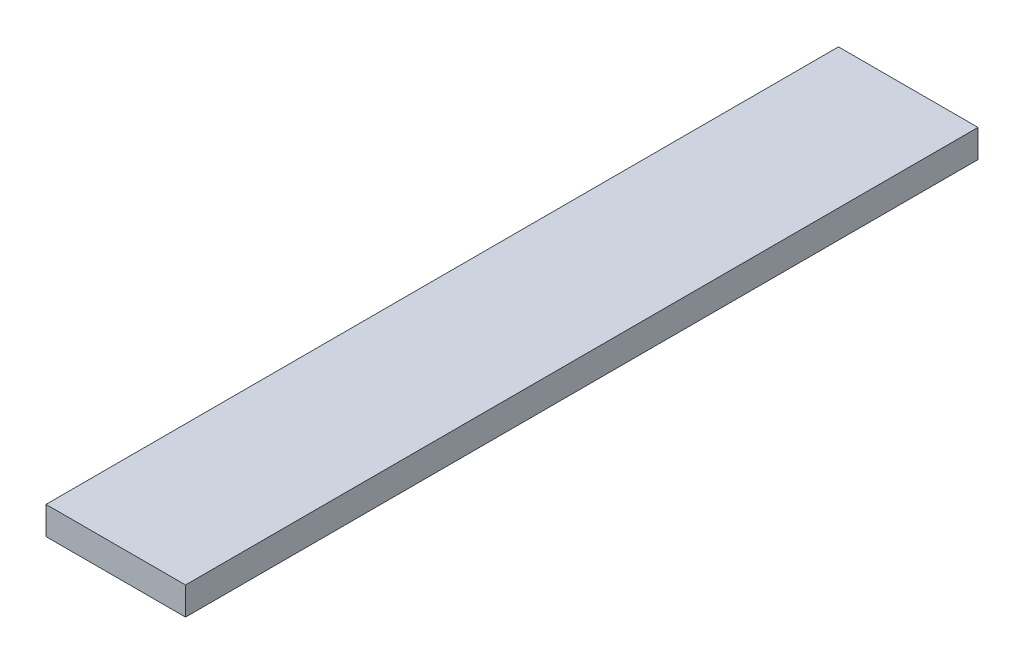
ISO-10303-21;
HEADER;
FILE_DESCRIPTION(('STEP AP214'),'2;1');
FILE_NAME('part.step','',(''),(''),'','','');
FILE_SCHEMA(('AUTOMOTIVE_DESIGN { 1 0 10303 214 1 1 1 1 }'));
ENDSEC;
DATA;
#1=APPLICATION_CONTEXT('core data for automotive mechanical design processes');
#2=APPLICATION_PROTOCOL_DEFINITION('international standard','automotive_design',2000,#1);
#3=PRODUCT_CONTEXT('',#1,'mechanical');
#4=PRODUCT('Part','Part','',(#3));
#5=PRODUCT_RELATED_PRODUCT_CATEGORY('part','',(#4));
#6=PRODUCT_DEFINITION_FORMATION('','',#4);
#7=PRODUCT_DEFINITION_CONTEXT('part definition',#1,'design');
#8=PRODUCT_DEFINITION('design','',#6,#7);
#9=PRODUCT_DEFINITION_SHAPE('','',#8);
#10=(LENGTH_UNIT() NAMED_UNIT(*) SI_UNIT(.MILLI.,.METRE.));
#11=(NAMED_UNIT(*) PLANE_ANGLE_UNIT() SI_UNIT($,.RADIAN.));
#12=(NAMED_UNIT(*) SI_UNIT($,.STERADIAN.) SOLID_ANGLE_UNIT());
#13=UNCERTAINTY_MEASURE_WITH_UNIT(LENGTH_MEASURE(1.E-05),#10,'distance_accuracy_value','');
#14=(GEOMETRIC_REPRESENTATION_CONTEXT(3) GLOBAL_UNCERTAINTY_ASSIGNED_CONTEXT((#13)) GLOBAL_UNIT_ASSIGNED_CONTEXT((#10,
#11,#12)) REPRESENTATION_CONTEXT('',''));
#15=CARTESIAN_POINT('',(0.,0.,0.));
#16=DIRECTION('',(0.,0.,1.));
#17=DIRECTION('',(1.,0.,0.));
#18=AXIS2_PLACEMENT_3D('',#15,#16,#17);
#19=CARTESIAN_POINT('',(0.,10.,0.));
#20=DIRECTION('',(0.,1.,0.));
#21=DIRECTION('',(0.,0.,1.));
#22=AXIS2_PLACEMENT_3D('',#19,#20,#21);
#23=PLANE('',#22);
#24=DIRECTION('',(-1.,0.,0.));
#25=VECTOR('',#24,1.);
#26=CARTESIAN_POINT('',(25.,10.,-142.));
#27=LINE('',#26,#25);
#28=CARTESIAN_POINT('',(-25.,10.,-142.));
#29=VERTEX_POINT('',#28);
#30=CARTESIAN_POINT('',(25.,10.,-142.));
#31=VERTEX_POINT('',#30);
#32=EDGE_CURVE('E68',#29,#31,#27,.F.);
#33=ORIENTED_EDGE('',*,*,#32,.F.);
#34=DIRECTION('',(0.,0.,1.));
#35=VECTOR('',#34,1.);
#36=CARTESIAN_POINT('',(-25.,10.,-142.));
#37=LINE('',#36,#35);
#38=CARTESIAN_POINT('',(-25.,10.,142.));
#39=VERTEX_POINT('',#38);
#40=EDGE_CURVE('E20',#39,#29,#37,.F.);
#41=ORIENTED_EDGE('',*,*,#40,.F.);
#42=DIRECTION('',(1.,0.,0.));
#43=VECTOR('',#42,1.);
#44=CARTESIAN_POINT('',(-25.,10.,142.));
#45=LINE('',#44,#43);
#46=CARTESIAN_POINT('',(25.,10.,142.));
#47=VERTEX_POINT('',#46);
#48=EDGE_CURVE('E58',#47,#39,#45,.F.);
#49=ORIENTED_EDGE('',*,*,#48,.F.);
#50=DIRECTION('',(0.,0.,-1.));
#51=VECTOR('',#50,1.);
#52=CARTESIAN_POINT('',(25.,10.,142.));
#53=LINE('',#52,#51);
#54=EDGE_CURVE('E53',#31,#47,#53,.F.);
#55=ORIENTED_EDGE('',*,*,#54,.F.);
#56=EDGE_LOOP('',(#33,#41,#49,#55));
#57=FACE_BOUND('',#56,.T.);
#58=ADVANCED_FACE('F17',(#57),#23,.T.);
#59=CARTESIAN_POINT('',(-25.,0.,-142.));
#60=DIRECTION('',(-1.,0.,0.));
#61=DIRECTION('',(0.,0.,1.));
#62=AXIS2_PLACEMENT_3D('',#59,#60,#61);
#63=PLANE('',#62);
#64=DIRECTION('',(0.,1.,0.));
#65=VECTOR('',#64,1.);
#66=CARTESIAN_POINT('',(-25.,0.,-142.));
#67=LINE('',#66,#65);
#68=CARTESIAN_POINT('',(-25.,0.,-142.));
#69=VERTEX_POINT('',#68);
#70=EDGE_CURVE('E79',#69,#29,#67,.T.);
#71=ORIENTED_EDGE('',*,*,#70,.F.);
#72=DIRECTION('',(0.,0.,1.));
#73=VECTOR('',#72,1.);
#74=CARTESIAN_POINT('',(-25.,0.,0.));
#75=LINE('',#74,#73);
#76=CARTESIAN_POINT('',(-25.,0.,142.));
#77=VERTEX_POINT('',#76);
#78=EDGE_CURVE('E74',#69,#77,#75,.T.);
#79=ORIENTED_EDGE('',*,*,#78,.T.);
#80=DIRECTION('',(0.,1.,0.));
#81=VECTOR('',#80,1.);
#82=CARTESIAN_POINT('',(-25.,0.,142.));
#83=LINE('',#82,#81);
#84=EDGE_CURVE('E63',#39,#77,#83,.F.);
#85=ORIENTED_EDGE('',*,*,#84,.F.);
#86=ORIENTED_EDGE('',*,*,#40,.T.);
#87=EDGE_LOOP('',(#71,#79,#85,#86));
#88=FACE_BOUND('',#87,.T.);
#89=ADVANCED_FACE('F73',(#88),#63,.T.);
#90=CARTESIAN_POINT('',(-25.,0.,142.));
#91=DIRECTION('',(0.,0.,1.));
#92=DIRECTION('',(1.,0.,0.));
#93=AXIS2_PLACEMENT_3D('',#90,#91,#92);
#94=PLANE('',#93);
#95=ORIENTED_EDGE('',*,*,#84,.T.);
#96=DIRECTION('',(1.,0.,0.));
#97=VECTOR('',#96,1.);
#98=CARTESIAN_POINT('',(0.,0.,142.));
#99=LINE('',#98,#97);
#100=CARTESIAN_POINT('',(25.,0.,142.));
#101=VERTEX_POINT('',#100);
#102=EDGE_CURVE('E84',#77,#101,#99,.T.);
#103=ORIENTED_EDGE('',*,*,#102,.T.);
#104=DIRECTION('',(0.,1.,0.));
#105=VECTOR('',#104,1.);
#106=CARTESIAN_POINT('',(25.,0.,142.));
#107=LINE('',#106,#105);
#108=EDGE_CURVE('E65',#47,#101,#107,.F.);
#109=ORIENTED_EDGE('',*,*,#108,.F.);
#110=ORIENTED_EDGE('',*,*,#48,.T.);
#111=EDGE_LOOP('',(#95,#103,#109,#110));
#112=FACE_BOUND('',#111,.T.);
#113=ADVANCED_FACE('F60',(#112),#94,.T.);
#114=CARTESIAN_POINT('',(25.,0.,142.));
#115=DIRECTION('',(1.,0.,0.));
#116=DIRECTION('',(0.,0.,-1.));
#117=AXIS2_PLACEMENT_3D('',#114,#115,#116);
#118=PLANE('',#117);
#119=ORIENTED_EDGE('',*,*,#108,.T.);
#120=DIRECTION('',(0.,0.,1.));
#121=VECTOR('',#120,1.);
#122=CARTESIAN_POINT('',(25.,0.,0.));
#123=LINE('',#122,#121);
#124=CARTESIAN_POINT('',(25.,0.,-142.));
#125=VERTEX_POINT('',#124);
#126=EDGE_CURVE('E26',#101,#125,#123,.F.);
#127=ORIENTED_EDGE('',*,*,#126,.T.);
#128=DIRECTION('',(0.,1.,0.));
#129=VECTOR('',#128,1.);
#130=CARTESIAN_POINT('',(25.,0.,-142.));
#131=LINE('',#130,#129);
#132=EDGE_CURVE('E34',#31,#125,#131,.F.);
#133=ORIENTED_EDGE('',*,*,#132,.F.);
#134=ORIENTED_EDGE('',*,*,#54,.T.);
#135=EDGE_LOOP('',(#119,#127,#133,#134));
#136=FACE_BOUND('',#135,.T.);
#137=ADVANCED_FACE('F88',(#136),#118,.T.);
#138=CARTESIAN_POINT('',(25.,0.,-142.));
#139=DIRECTION('',(0.,0.,-1.));
#140=DIRECTION('',(-1.,0.,0.));
#141=AXIS2_PLACEMENT_3D('',#138,#139,#140);
#142=PLANE('',#141);
#143=ORIENTED_EDGE('',*,*,#132,.T.);
#144=DIRECTION('',(1.,0.,0.));
#145=VECTOR('',#144,1.);
#146=CARTESIAN_POINT('',(0.,0.,-142.));
#147=LINE('',#146,#145);
#148=EDGE_CURVE('E11',#125,#69,#147,.F.);
#149=ORIENTED_EDGE('',*,*,#148,.T.);
#150=ORIENTED_EDGE('',*,*,#70,.T.);
#151=ORIENTED_EDGE('',*,*,#32,.T.);
#152=EDGE_LOOP('',(#143,#149,#150,#151));
#153=FACE_BOUND('',#152,.T.);
#154=ADVANCED_FACE('F91',(#153),#142,.T.);
#155=CARTESIAN_POINT('',(0.,0.,0.));
#156=DIRECTION('',(0.,1.,0.));
#157=DIRECTION('',(0.,0.,1.));
#158=AXIS2_PLACEMENT_3D('',#155,#156,#157);
#159=PLANE('',#158);
#160=ORIENTED_EDGE('',*,*,#126,.F.);
#161=ORIENTED_EDGE('',*,*,#102,.F.);
#162=ORIENTED_EDGE('',*,*,#78,.F.);
#163=ORIENTED_EDGE('',*,*,#148,.F.);
#164=EDGE_LOOP('',(#160,#161,#162,#163));
#165=FACE_BOUND('',#164,.T.);
#166=ADVANCED_FACE('F90',(#165),#159,.F.);
#167=CLOSED_SHELL('',(#58,#89,#113,#137,#154,#166));
#168=MANIFOLD_SOLID_BREP('B1',#167);
#169=ADVANCED_BREP_SHAPE_REPRESENTATION('',(#18,#168),#14);
#170=SHAPE_DEFINITION_REPRESENTATION(#9,#169);
ENDSEC;
END-ISO-10303-21;
